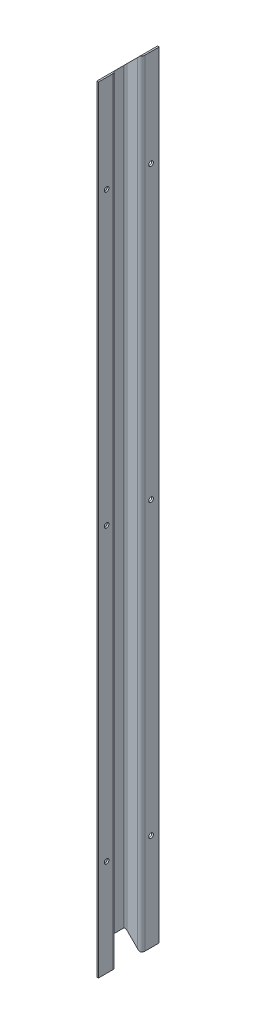
ISO-10303-21;
HEADER;
FILE_DESCRIPTION(('STEP AP214'),'2;1');
FILE_NAME('part.step','',(''),(''),'','','');
FILE_SCHEMA(('AUTOMOTIVE_DESIGN { 1 0 10303 214 1 1 1 1 }'));
ENDSEC;
DATA;
#1=APPLICATION_CONTEXT('core data for automotive mechanical design processes');
#2=APPLICATION_PROTOCOL_DEFINITION('international standard','automotive_design',2000,#1);
#3=PRODUCT_CONTEXT('',#1,'mechanical');
#4=PRODUCT('Part','Part','',(#3));
#5=PRODUCT_RELATED_PRODUCT_CATEGORY('part','',(#4));
#6=PRODUCT_DEFINITION_FORMATION('','',#4);
#7=PRODUCT_DEFINITION_CONTEXT('part definition',#1,'design');
#8=PRODUCT_DEFINITION('design','',#6,#7);
#9=PRODUCT_DEFINITION_SHAPE('','',#8);
#10=(LENGTH_UNIT() NAMED_UNIT(*) SI_UNIT(.MILLI.,.METRE.));
#11=(NAMED_UNIT(*) PLANE_ANGLE_UNIT() SI_UNIT($,.RADIAN.));
#12=(NAMED_UNIT(*) SI_UNIT($,.STERADIAN.) SOLID_ANGLE_UNIT());
#13=UNCERTAINTY_MEASURE_WITH_UNIT(LENGTH_MEASURE(1.E-05),#10,'distance_accuracy_value','');
#14=(GEOMETRIC_REPRESENTATION_CONTEXT(3) GLOBAL_UNCERTAINTY_ASSIGNED_CONTEXT((#13)) GLOBAL_UNIT_ASSIGNED_CONTEXT((#10,
#11,#12)) REPRESENTATION_CONTEXT('',''));
#15=CARTESIAN_POINT('',(0.,0.,0.));
#16=DIRECTION('',(0.,0.,1.));
#17=DIRECTION('',(1.,0.,0.));
#18=AXIS2_PLACEMENT_3D('',#15,#16,#17);
#19=CARTESIAN_POINT('',(12.7,-1219.2,-249.017002367974));
#20=DIRECTION('',(0.,0.,1.));
#21=DIRECTION('',(1.,0.,0.));
#22=AXIS2_PLACEMENT_3D('',#19,#20,#21);
#23=PLANE('',#22);
#24=DIRECTION('',(-0.707106781186548,0.707106781186548,0.));
#25=VECTOR('',#24,1.);
#26=CARTESIAN_POINT('',(12.568493857373,-1206.36849385737,-249.017002367974));
#27=LINE('',#26,#25);
#28=CARTESIAN_POINT('',(22.8092,-1216.6092,-249.017002367974));
#29=VERTEX_POINT('',#28);
#30=CARTESIAN_POINT('',(5.7658,-1199.5658,-249.017002367974));
#31=VERTEX_POINT('',#30);
#32=EDGE_CURVE('E371',#29,#31,#27,.T.);
#33=ORIENTED_EDGE('',*,*,#32,.F.);
#34=DIRECTION('',(0.,1.,0.));
#35=VECTOR('',#34,1.);
#36=CARTESIAN_POINT('',(22.8092,0.,-249.017002367974));
#37=LINE('',#36,#35);
#38=CARTESIAN_POINT('',(22.8092,-2.5908,-249.017002367974));
#39=VERTEX_POINT('',#38);
#40=EDGE_CURVE('E293',#29,#39,#37,.T.);
#41=ORIENTED_EDGE('',*,*,#40,.T.);
#42=DIRECTION('',(-0.707106781186548,-0.707106781186547,0.));
#43=VECTOR('',#42,1.);
#44=CARTESIAN_POINT('',(14.8809205779453,-10.5190794220546,-249.017002367974));
#45=LINE('',#44,#43);
#46=CARTESIAN_POINT('',(5.7658,-19.6342,-249.017002367974));
#47=VERTEX_POINT('',#46);
#48=EDGE_CURVE('E219',#39,#47,#45,.T.);
#49=ORIENTED_EDGE('',*,*,#48,.T.);
#50=DIRECTION('',(0.,1.,0.));
#51=VECTOR('',#50,1.);
#52=CARTESIAN_POINT('',(5.7658,-1219.2,-249.017002367974));
#53=LINE('',#52,#51);
#54=EDGE_CURVE('E496',#47,#31,#53,.F.);
#55=ORIENTED_EDGE('',*,*,#54,.T.);
#56=EDGE_LOOP('',(#33,#41,#49,#55));
#57=FACE_BOUND('',#56,.T.);
#58=ADVANCED_FACE('F16',(#57),#23,.T.);
#59=CARTESIAN_POINT('',(0.,-1219.2,-271.242002367973));
#60=DIRECTION('',(1.,0.,0.));
#61=DIRECTION('',(0.,0.,-1.));
#62=AXIS2_PLACEMENT_3D('',#59,#60,#61);
#63=PLANE('',#62);
#64=DIRECTION('',(0.,0.,-1.));
#65=VECTOR('',#64,1.);
#66=CARTESIAN_POINT('',(0.,-1193.8,-249.017002367974));
#67=LINE('',#66,#65);
#68=CARTESIAN_POINT('',(0.,-1193.8,-254.782802367973));
#69=VERTEX_POINT('',#68);
#70=CARTESIAN_POINT('',(0.,-1193.8,-287.701202367973));
#71=VERTEX_POINT('',#70);
#72=EDGE_CURVE('E374',#69,#71,#67,.T.);
#73=ORIENTED_EDGE('',*,*,#72,.F.);
#74=DIRECTION('',(0.,1.,0.));
#75=VECTOR('',#74,1.);
#76=CARTESIAN_POINT('',(0.,0.,-254.782802367973));
#77=LINE('',#76,#75);
#78=CARTESIAN_POINT('',(0.,-25.4,-254.782802367973));
#79=VERTEX_POINT('',#78);
#80=EDGE_CURVE('E486',#69,#79,#77,.T.);
#81=ORIENTED_EDGE('',*,*,#80,.T.);
#82=DIRECTION('',(0.,0.,-1.));
#83=VECTOR('',#82,1.);
#84=CARTESIAN_POINT('',(0.,-25.4,-249.017002367974));
#85=LINE('',#84,#83);
#86=CARTESIAN_POINT('',(0.,-25.4,-287.701202367973));
#87=VERTEX_POINT('',#86);
#88=EDGE_CURVE('E386',#79,#87,#85,.T.);
#89=ORIENTED_EDGE('',*,*,#88,.T.);
#90=DIRECTION('',(0.,1.,0.));
#91=VECTOR('',#90,1.);
#92=CARTESIAN_POINT('',(0.,-1219.2,-287.701202367973));
#93=LINE('',#92,#91);
#94=EDGE_CURVE('E229',#87,#71,#93,.F.);
#95=ORIENTED_EDGE('',*,*,#94,.T.);
#96=EDGE_LOOP('',(#73,#81,#89,#95));
#97=FACE_BOUND('',#96,.T.);
#98=ADVANCED_FACE('F539',(#97),#63,.F.);
#99=CARTESIAN_POINT('',(12.7,-1219.2,-293.467002367973));
#100=DIRECTION('',(0.,0.,1.));
#101=DIRECTION('',(1.,0.,0.));
#102=AXIS2_PLACEMENT_3D('',#99,#100,#101);
#103=PLANE('',#102);
#104=DIRECTION('',(-0.707106781186548,-0.707106781186547,0.));
#105=VECTOR('',#104,1.);
#106=CARTESIAN_POINT('',(14.8809205779453,-10.5190794220546,-293.467002367973));
#107=LINE('',#106,#105);
#108=CARTESIAN_POINT('',(22.8092,-2.5908,-293.467002367973));
#109=VERTEX_POINT('',#108);
#110=CARTESIAN_POINT('',(5.7658,-19.6342,-293.467002367973));
#111=VERTEX_POINT('',#110);
#112=EDGE_CURVE('E207',#109,#111,#107,.T.);
#113=ORIENTED_EDGE('',*,*,#112,.F.);
#114=DIRECTION('',(0.,1.,0.));
#115=VECTOR('',#114,1.);
#116=CARTESIAN_POINT('',(22.8092,-1219.2,-293.467002367973));
#117=LINE('',#116,#115);
#118=CARTESIAN_POINT('',(22.8092,-1216.6092,-293.467002367973));
#119=VERTEX_POINT('',#118);
#120=EDGE_CURVE('E278',#109,#119,#117,.F.);
#121=ORIENTED_EDGE('',*,*,#120,.T.);
#122=DIRECTION('',(-0.707106781186548,0.707106781186548,0.));
#123=VECTOR('',#122,1.);
#124=CARTESIAN_POINT('',(12.568493857373,-1206.36849385737,-293.467002367973));
#125=LINE('',#124,#123);
#126=CARTESIAN_POINT('',(5.7658,-1199.5658,-293.467002367973));
#127=VERTEX_POINT('',#126);
#128=EDGE_CURVE('E236',#119,#127,#125,.T.);
#129=ORIENTED_EDGE('',*,*,#128,.T.);
#130=DIRECTION('',(0.,1.,0.));
#131=VECTOR('',#130,1.);
#132=CARTESIAN_POINT('',(5.7658,-1219.2,-293.467002367973));
#133=LINE('',#132,#131);
#134=EDGE_CURVE('E227',#127,#111,#133,.T.);
#135=ORIENTED_EDGE('',*,*,#134,.T.);
#136=EDGE_LOOP('',(#113,#121,#129,#135));
#137=FACE_BOUND('',#136,.T.);
#138=ADVANCED_FACE('F234',(#137),#103,.F.);
#139=CARTESIAN_POINT('',(26.6954,-1219.2,-290.866042367973));
#140=DIRECTION('',(0.,0.,1.));
#141=DIRECTION('',(1.,0.,0.));
#142=AXIS2_PLACEMENT_3D('',#139,#140,#141);
#143=PLANE('',#142);
#144=DIRECTION('',(0.707106781186548,0.707106781186547,0.));
#145=VECTOR('',#144,1.);
#146=CARTESIAN_POINT('',(-583.5523,-608.9523,-290.866042367973));
#147=LINE('',#146,#145);
#148=CARTESIAN_POINT('',(5.19176,-20.20824,-290.866042367973));
#149=VERTEX_POINT('',#148);
#150=CARTESIAN_POINT('',(22.225,-3.17500000000015,-290.866042367973));
#151=VERTEX_POINT('',#150);
#152=EDGE_CURVE('E399',#149,#151,#147,.T.);
#153=ORIENTED_EDGE('',*,*,#152,.F.);
#154=DIRECTION('',(0.,1.,0.));
#155=VECTOR('',#154,1.);
#156=CARTESIAN_POINT('',(5.19176,-1196.40096,-290.866042367973));
#157=LINE('',#156,#155);
#158=CARTESIAN_POINT('',(5.19176,-1198.99176,-290.866042367973));
#159=VERTEX_POINT('',#158);
#160=EDGE_CURVE('E287',#149,#159,#157,.F.);
#161=ORIENTED_EDGE('',*,*,#160,.T.);
#162=DIRECTION('',(0.707106781186548,-0.707106781186548,0.));
#163=VECTOR('',#162,1.);
#164=CARTESIAN_POINT('',(26.0477,-1219.8477,-290.866042367973));
#165=LINE('',#164,#163);
#166=CARTESIAN_POINT('',(22.225,-1216.025,-290.866042367973));
#167=VERTEX_POINT('',#166);
#168=EDGE_CURVE('E413',#159,#167,#165,.T.);
#169=ORIENTED_EDGE('',*,*,#168,.T.);
#170=DIRECTION('',(0.,1.,0.));
#171=VECTOR('',#170,1.);
#172=CARTESIAN_POINT('',(22.225,-1219.2,-290.866042367973));
#173=LINE('',#172,#171);
#174=EDGE_CURVE('E239',#167,#151,#173,.T.);
#175=ORIENTED_EDGE('',*,*,#174,.T.);
#176=EDGE_LOOP('',(#153,#161,#169,#175));
#177=FACE_BOUND('',#176,.T.);
#178=ADVANCED_FACE('F561',(#177),#143,.T.);
#179=CARTESIAN_POINT('',(2.60096,-1219.2,-271.242002367973));
#180=DIRECTION('',(1.,0.,0.));
#181=DIRECTION('',(0.,0.,-1.));
#182=AXIS2_PLACEMENT_3D('',#179,#180,#181);
#183=PLANE('',#182);
#184=DIRECTION('',(0.,0.,-1.));
#185=VECTOR('',#184,1.);
#186=CARTESIAN_POINT('',(2.60096,-1196.40096,-271.242002367973));
#187=LINE('',#186,#185);
#188=CARTESIAN_POINT('',(2.60096,-1196.40096,-254.208762367973));
#189=VERTEX_POINT('',#188);
#190=CARTESIAN_POINT('',(2.60096,-1196.40096,-288.275242367973));
#191=VERTEX_POINT('',#190);
#192=EDGE_CURVE('E409',#189,#191,#187,.T.);
#193=ORIENTED_EDGE('',*,*,#192,.T.);
#194=DIRECTION('',(0.,1.,0.));
#195=VECTOR('',#194,1.);
#196=CARTESIAN_POINT('',(2.60096,-22.79904,-288.275242367973));
#197=LINE('',#196,#195);
#198=CARTESIAN_POINT('',(2.60096,-22.79904,-288.275242367973));
#199=VERTEX_POINT('',#198);
#200=EDGE_CURVE('E284',#191,#199,#197,.T.);
#201=ORIENTED_EDGE('',*,*,#200,.T.);
#202=DIRECTION('',(0.,0.,-1.));
#203=VECTOR('',#202,1.);
#204=CARTESIAN_POINT('',(2.60096,-22.79904,-271.242002367973));
#205=LINE('',#204,#203);
#206=CARTESIAN_POINT('',(2.60096,-22.79904,-254.208762367973));
#207=VERTEX_POINT('',#206);
#208=EDGE_CURVE('E395',#207,#199,#205,.T.);
#209=ORIENTED_EDGE('',*,*,#208,.F.);
#210=DIRECTION('',(0.,1.,0.));
#211=VECTOR('',#210,1.);
#212=CARTESIAN_POINT('',(2.60096,-1219.2,-254.208762367973));
#213=LINE('',#212,#211);
#214=EDGE_CURVE('E281',#207,#189,#213,.F.);
#215=ORIENTED_EDGE('',*,*,#214,.T.);
#216=EDGE_LOOP('',(#193,#201,#209,#215));
#217=FACE_BOUND('',#216,.T.);
#218=ADVANCED_FACE('F551',(#217),#183,.T.);
#219=CARTESIAN_POINT('',(14.00048,-1219.2,-251.617962367973));
#220=DIRECTION('',(0.,0.,1.));
#221=DIRECTION('',(1.,0.,0.));
#222=AXIS2_PLACEMENT_3D('',#219,#220,#221);
#223=PLANE('',#222);
#224=DIRECTION('',(0.707106781186548,-0.707106781186548,0.));
#225=VECTOR('',#224,1.);
#226=CARTESIAN_POINT('',(19.70024,-1213.50024,-251.617962367973));
#227=LINE('',#226,#225);
#228=CARTESIAN_POINT('',(5.19176,-1198.99176,-251.617962367973));
#229=VERTEX_POINT('',#228);
#230=CARTESIAN_POINT('',(22.225,-1216.025,-251.617962367973));
#231=VERTEX_POINT('',#230);
#232=EDGE_CURVE('E406',#229,#231,#227,.T.);
#233=ORIENTED_EDGE('',*,*,#232,.F.);
#234=DIRECTION('',(0.,1.,0.));
#235=VECTOR('',#234,1.);
#236=CARTESIAN_POINT('',(5.19176,-1219.2,-251.617962367973));
#237=LINE('',#236,#235);
#238=CARTESIAN_POINT('',(5.19175999999988,-20.20824,-251.617962367973));
#239=VERTEX_POINT('',#238);
#240=EDGE_CURVE('E289',#229,#239,#237,.T.);
#241=ORIENTED_EDGE('',*,*,#240,.T.);
#242=DIRECTION('',(0.707106781186548,0.707106781186547,0.));
#243=VECTOR('',#242,1.);
#244=CARTESIAN_POINT('',(-589.89976,-615.29976,-251.617962367973));
#245=LINE('',#244,#243);
#246=CARTESIAN_POINT('',(22.225,-3.17500000000015,-251.617962367973));
#247=VERTEX_POINT('',#246);
#248=EDGE_CURVE('E384',#239,#247,#245,.T.);
#249=ORIENTED_EDGE('',*,*,#248,.T.);
#250=DIRECTION('',(0.,1.,0.));
#251=VECTOR('',#250,1.);
#252=CARTESIAN_POINT('',(22.225,-1219.2,-251.617962367973));
#253=LINE('',#252,#251);
#254=EDGE_CURVE('E262',#247,#231,#253,.F.);
#255=ORIENTED_EDGE('',*,*,#254,.T.);
#256=EDGE_LOOP('',(#233,#241,#249,#255));
#257=FACE_BOUND('',#256,.T.);
#258=ADVANCED_FACE('F543',(#257),#223,.F.);
#259=CARTESIAN_POINT('',(13.9954,-1219.2,-271.242002367973));
#260=DIRECTION('',(0.,-1.,0.));
#261=DIRECTION('',(1.,0.,0.));
#262=AXIS2_PLACEMENT_3D('',#259,#260,#261);
#263=PLANE('',#262);
#264=DIRECTION('',(0.,0.,1.));
#265=VECTOR('',#264,1.);
#266=CARTESIAN_POINT('',(25.4,-1219.2,-236.317002367974));
#267=LINE('',#266,#265);
#268=CARTESIAN_POINT('',(25.4,-1219.2,-246.426202367974));
#269=VERTEX_POINT('',#268);
#270=CARTESIAN_POINT('',(25.4,-1219.2,-223.617002367974));
#271=VERTEX_POINT('',#270);
#272=EDGE_CURVE('E447',#269,#271,#267,.T.);
#273=ORIENTED_EDGE('',*,*,#272,.F.);
#274=DIRECTION('',(0.,0.,-1.));
#275=VECTOR('',#274,1.);
#276=CARTESIAN_POINT('',(25.4,-1219.2,-249.017002367974));
#277=LINE('',#276,#275);
#278=CARTESIAN_POINT('',(25.4,-1219.2,-250.665043484311));
#279=VERTEX_POINT('',#278);
#280=EDGE_CURVE('E380',#269,#279,#277,.T.);
#281=ORIENTED_EDGE('',*,*,#280,.T.);
#282=CARTESIAN_POINT('',(22.225,-1219.2,-245.852162367974));
#283=DIRECTION('',(0.,-1.,0.));
#284=DIRECTION('',(0.,0.,-1.));
#285=AXIS2_PLACEMENT_3D('',#282,#283,#284);
#286=CIRCLE('',#285,5.7658);
#287=CARTESIAN_POINT('',(27.9908,-1219.2,-245.852162367974));
#288=VERTEX_POINT('',#287);
#289=EDGE_CURVE('E252',#279,#288,#286,.T.);
#290=ORIENTED_EDGE('',*,*,#289,.T.);
#291=DIRECTION('',(0.,0.,-1.));
#292=VECTOR('',#291,1.);
#293=CARTESIAN_POINT('',(27.9908,-1219.2,-250.317482367973));
#294=LINE('',#293,#292);
#295=CARTESIAN_POINT('',(27.9908,-1219.2,-223.617002367974));
#296=VERTEX_POINT('',#295);
#297=EDGE_CURVE('E439',#296,#288,#294,.T.);
#298=ORIENTED_EDGE('',*,*,#297,.F.);
#299=DIRECTION('',(1.,0.,0.));
#300=VECTOR('',#299,1.);
#301=CARTESIAN_POINT('',(26.6954,-1219.2,-223.617002367974));
#302=LINE('',#301,#300);
#303=EDGE_CURVE('E443',#271,#296,#302,.T.);
#304=ORIENTED_EDGE('',*,*,#303,.F.);
#305=EDGE_LOOP('',(#273,#281,#290,#298,#304));
#306=FACE_BOUND('',#305,.T.);
#307=ADVANCED_FACE('F505',(#306),#263,.T.);
#308=CARTESIAN_POINT('',(22.225,-1219.2,-296.631842367973));
#309=DIRECTION('',(0.,-1.,0.));
#310=DIRECTION('',(0.,0.,-1.));
#311=AXIS2_PLACEMENT_3D('',#308,#309,#310);
#312=CIRCLE('',#311,5.7658);
#313=CARTESIAN_POINT('',(27.9908,-1219.2,-296.631842367973));
#314=VERTEX_POINT('',#313);
#315=CARTESIAN_POINT('',(25.4,-1219.2,-291.818961251635));
#316=VERTEX_POINT('',#315);
#317=EDGE_CURVE('E240',#314,#316,#312,.T.);
#318=ORIENTED_EDGE('',*,*,#317,.T.);
#319=CARTESIAN_POINT('',(25.4,-1219.2,-296.057802367973));
#320=VERTEX_POINT('',#319);
#321=EDGE_CURVE('E379',#316,#320,#277,.T.);
#322=ORIENTED_EDGE('',*,*,#321,.T.);
#323=DIRECTION('',(0.,0.,-1.));
#324=VECTOR('',#323,1.);
#325=CARTESIAN_POINT('',(25.4,-1219.2,-306.167002367974));
#326=LINE('',#325,#324);
#327=CARTESIAN_POINT('',(25.4,-1219.2,-318.867002367973));
#328=VERTEX_POINT('',#327);
#329=EDGE_CURVE('E428',#320,#328,#326,.T.);
#330=ORIENTED_EDGE('',*,*,#329,.T.);
#331=DIRECTION('',(1.,0.,0.));
#332=VECTOR('',#331,1.);
#333=CARTESIAN_POINT('',(26.6954,-1219.2,-318.867002367973));
#334=LINE('',#333,#332);
#335=CARTESIAN_POINT('',(27.9908,-1219.2,-318.867002367973));
#336=VERTEX_POINT('',#335);
#337=EDGE_CURVE('E431',#328,#336,#334,.T.);
#338=ORIENTED_EDGE('',*,*,#337,.T.);
#339=DIRECTION('',(0.,0.,-1.));
#340=VECTOR('',#339,1.);
#341=CARTESIAN_POINT('',(27.9908,-1219.2,-306.167002367974));
#342=LINE('',#341,#340);
#343=EDGE_CURVE('E436',#314,#336,#342,.T.);
#344=ORIENTED_EDGE('',*,*,#343,.F.);
#345=EDGE_LOOP('',(#318,#322,#330,#338,#344));
#346=FACE_BOUND('',#345,.T.);
#347=ADVANCED_FACE('F750',(#346),#263,.T.);
#348=CARTESIAN_POINT('',(13.9954,0.,-271.242002367973));
#349=DIRECTION('',(0.,-1.,0.));
#350=DIRECTION('',(1.,0.,0.));
#351=AXIS2_PLACEMENT_3D('',#348,#349,#350);
#352=PLANE('',#351);
#353=DIRECTION('',(0.,0.,-1.));
#354=VECTOR('',#353,1.);
#355=CARTESIAN_POINT('',(25.4,0.,-249.017002367974));
#356=LINE('',#355,#354);
#357=CARTESIAN_POINT('',(25.4,0.,-246.426202367974));
#358=VERTEX_POINT('',#357);
#359=CARTESIAN_POINT('',(25.4,0.,-250.665043484311));
#360=VERTEX_POINT('',#359);
#361=EDGE_CURVE('E40',#358,#360,#356,.T.);
#362=ORIENTED_EDGE('',*,*,#361,.F.);
#363=DIRECTION('',(0.,0.,1.));
#364=VECTOR('',#363,1.);
#365=CARTESIAN_POINT('',(25.4,0.,-236.317002367974));
#366=LINE('',#365,#364);
#367=CARTESIAN_POINT('',(25.4,0.,-223.617002367974));
#368=VERTEX_POINT('',#367);
#369=EDGE_CURVE('E432',#358,#368,#366,.T.);
#370=ORIENTED_EDGE('',*,*,#369,.T.);
#371=DIRECTION('',(1.,0.,0.));
#372=VECTOR('',#371,1.);
#373=CARTESIAN_POINT('',(26.6954,0.,-223.617002367974));
#374=LINE('',#373,#372);
#375=CARTESIAN_POINT('',(27.9908,0.,-223.617002367974));
#376=VERTEX_POINT('',#375);
#377=EDGE_CURVE('E464',#368,#376,#374,.T.);
#378=ORIENTED_EDGE('',*,*,#377,.T.);
#379=DIRECTION('',(0.,0.,-1.));
#380=VECTOR('',#379,1.);
#381=CARTESIAN_POINT('',(27.9908,0.,-250.317482367973));
#382=LINE('',#381,#380);
#383=CARTESIAN_POINT('',(27.9908,0.,-245.852162367974));
#384=VERTEX_POINT('',#383);
#385=EDGE_CURVE('E460',#376,#384,#382,.T.);
#386=ORIENTED_EDGE('',*,*,#385,.T.);
#387=CARTESIAN_POINT('',(22.225,0.,-245.852162367974));
#388=DIRECTION('',(0.,-1.,0.));
#389=DIRECTION('',(0.,0.,-1.));
#390=AXIS2_PLACEMENT_3D('',#387,#388,#389);
#391=CIRCLE('',#390,5.7658);
#392=EDGE_CURVE('E490',#384,#360,#391,.F.);
#393=ORIENTED_EDGE('',*,*,#392,.T.);
#394=EDGE_LOOP('',(#362,#370,#378,#386,#393));
#395=FACE_BOUND('',#394,.T.);
#396=ADVANCED_FACE('F516',(#395),#352,.F.);
#397=CARTESIAN_POINT('',(25.4,0.,-291.818961251635));
#398=VERTEX_POINT('',#397);
#399=CARTESIAN_POINT('',(25.4,0.,-296.057802367973));
#400=VERTEX_POINT('',#399);
#401=EDGE_CURVE('E390',#398,#400,#356,.T.);
#402=ORIENTED_EDGE('',*,*,#401,.F.);
#403=CARTESIAN_POINT('',(22.225,0.,-296.631842367973));
#404=DIRECTION('',(0.,-1.,0.));
#405=DIRECTION('',(0.,0.,-1.));
#406=AXIS2_PLACEMENT_3D('',#403,#404,#405);
#407=CIRCLE('',#406,5.7658);
#408=CARTESIAN_POINT('',(27.9908,0.,-296.631842367973));
#409=VERTEX_POINT('',#408);
#410=EDGE_CURVE('E493',#398,#409,#407,.F.);
#411=ORIENTED_EDGE('',*,*,#410,.T.);
#412=DIRECTION('',(0.,0.,-1.));
#413=VECTOR('',#412,1.);
#414=CARTESIAN_POINT('',(27.9908,0.,-306.167002367974));
#415=LINE('',#414,#413);
#416=CARTESIAN_POINT('',(27.9908,0.,-318.867002367973));
#417=VERTEX_POINT('',#416);
#418=EDGE_CURVE('E457',#409,#417,#415,.T.);
#419=ORIENTED_EDGE('',*,*,#418,.T.);
#420=DIRECTION('',(1.,0.,0.));
#421=VECTOR('',#420,1.);
#422=CARTESIAN_POINT('',(26.6954,0.,-318.867002367973));
#423=LINE('',#422,#421);
#424=CARTESIAN_POINT('',(25.4,0.,-318.867002367973));
#425=VERTEX_POINT('',#424);
#426=EDGE_CURVE('E453',#425,#417,#423,.T.);
#427=ORIENTED_EDGE('',*,*,#426,.F.);
#428=DIRECTION('',(0.,0.,-1.));
#429=VECTOR('',#428,1.);
#430=CARTESIAN_POINT('',(25.4,0.,-306.167002367974));
#431=LINE('',#430,#429);
#432=EDGE_CURVE('E427',#400,#425,#431,.T.);
#433=ORIENTED_EDGE('',*,*,#432,.F.);
#434=EDGE_LOOP('',(#402,#411,#419,#427,#433));
#435=FACE_BOUND('',#434,.T.);
#436=ADVANCED_FACE('F573',(#435),#352,.F.);
#437=CARTESIAN_POINT('',(5.7658,-1219.2,-254.782802367973));
#438=DIRECTION('',(0.,-1.,0.));
#439=DIRECTION('',(0.,0.,-1.));
#440=AXIS2_PLACEMENT_3D('',#437,#438,#439);
#441=CYLINDRICAL_SURFACE('',#440,5.7658);
#442=ORIENTED_EDGE('',*,*,#80,.F.);
#443=CARTESIAN_POINT('',(5.7658,-1199.5658,-254.782802367973));
#444=DIRECTION('',(-0.707106781186548,-0.707106781186547,0.));
#445=DIRECTION('',(0.707106781186547,-0.707106781186548,0.));
#446=AXIS2_PLACEMENT_3D('',#443,#444,#445);
#447=ELLIPSE('',#446,8.1540725579308,5.7658);
#448=EDGE_CURVE('E423',#69,#31,#447,.F.);
#449=ORIENTED_EDGE('',*,*,#448,.T.);
#450=ORIENTED_EDGE('',*,*,#54,.F.);
#451=CARTESIAN_POINT('',(5.7658,-19.6342,-254.782802367973));
#452=DIRECTION('',(0.707106781186547,-0.707106781186548,0.));
#453=DIRECTION('',(-0.707106781186548,-0.707106781186547,0.));
#454=AXIS2_PLACEMENT_3D('',#451,#452,#453);
#455=ELLIPSE('',#454,8.15407255793079,5.7658);
#456=EDGE_CURVE('E231',#79,#47,#455,.F.);
#457=ORIENTED_EDGE('',*,*,#456,.F.);
#458=EDGE_LOOP('',(#442,#449,#450,#457));
#459=FACE_BOUND('',#458,.T.);
#460=ADVANCED_FACE('F536',(#459),#441,.T.);
#461=CARTESIAN_POINT('',(5.7658,-1219.2,-287.701202367973));
#462=DIRECTION('',(0.,1.,0.));
#463=DIRECTION('',(0.,0.,1.));
#464=AXIS2_PLACEMENT_3D('',#461,#462,#463);
#465=CYLINDRICAL_SURFACE('',#464,5.7658);
#466=ORIENTED_EDGE('',*,*,#134,.F.);
#467=CARTESIAN_POINT('',(5.7658,-1199.5658,-287.701202367973));
#468=DIRECTION('',(-0.707106781186548,-0.707106781186547,0.));
#469=DIRECTION('',(-0.707106781186547,0.707106781186548,0.));
#470=AXIS2_PLACEMENT_3D('',#467,#468,#469);
#471=ELLIPSE('',#470,8.1540725579308,5.7658);
#472=EDGE_CURVE('E420',#127,#71,#471,.F.);
#473=ORIENTED_EDGE('',*,*,#472,.T.);
#474=ORIENTED_EDGE('',*,*,#94,.F.);
#475=CARTESIAN_POINT('',(5.7658,-19.6342,-287.701202367973));
#476=DIRECTION('',(0.707106781186547,-0.707106781186548,0.));
#477=DIRECTION('',(0.707106781186548,0.707106781186547,0.));
#478=AXIS2_PLACEMENT_3D('',#475,#476,#477);
#479=ELLIPSE('',#478,8.15407255793079,5.7658);
#480=EDGE_CURVE('E211',#111,#87,#479,.F.);
#481=ORIENTED_EDGE('',*,*,#480,.F.);
#482=EDGE_LOOP('',(#466,#473,#474,#481));
#483=FACE_BOUND('',#482,.T.);
#484=ADVANCED_FACE('F225',(#483),#465,.T.);
#485=CARTESIAN_POINT('',(22.225,-1219.2,-296.631842367973));
#486=DIRECTION('',(0.,1.,0.));
#487=DIRECTION('',(0.,0.,1.));
#488=AXIS2_PLACEMENT_3D('',#485,#486,#487);
#489=CYLINDRICAL_SURFACE('',#488,5.7658);
#490=ORIENTED_EDGE('',*,*,#174,.F.);
#491=CARTESIAN_POINT('',(22.225,-1216.025,-296.631842367973));
#492=DIRECTION('',(-0.707106781186548,-0.707106781186547,0.));
#493=DIRECTION('',(-0.707106781186547,0.707106781186548,0.));
#494=AXIS2_PLACEMENT_3D('',#491,#492,#493);
#495=ELLIPSE('',#494,8.1540725579308,5.7658);
#496=EDGE_CURVE('E416',#167,#316,#495,.F.);
#497=ORIENTED_EDGE('',*,*,#496,.T.);
#498=ORIENTED_EDGE('',*,*,#317,.F.);
#499=DIRECTION('',(0.,1.,0.));
#500=VECTOR('',#499,1.);
#501=CARTESIAN_POINT('',(27.9908,-1219.2,-296.631842367973));
#502=LINE('',#501,#500);
#503=EDGE_CURVE('E248',#409,#314,#502,.F.);
#504=ORIENTED_EDGE('',*,*,#503,.F.);
#505=ORIENTED_EDGE('',*,*,#410,.F.);
#506=CARTESIAN_POINT('',(22.225,-3.17500000000015,-296.631842367973));
#507=DIRECTION('',(0.707106781186547,-0.707106781186548,0.));
#508=DIRECTION('',(0.707106781186548,0.707106781186547,0.));
#509=AXIS2_PLACEMENT_3D('',#506,#507,#508);
#510=ELLIPSE('',#509,8.15407255793079,5.7658);
#511=EDGE_CURVE('E232',#151,#398,#510,.F.);
#512=ORIENTED_EDGE('',*,*,#511,.F.);
#513=EDGE_LOOP('',(#490,#497,#498,#504,#505,#512));
#514=FACE_BOUND('',#513,.T.);
#515=ADVANCED_FACE('F566',(#514),#489,.T.);
#516=CARTESIAN_POINT('',(22.225,-1219.2,-245.852162367974));
#517=DIRECTION('',(0.,-1.,0.));
#518=DIRECTION('',(0.,0.,-1.));
#519=AXIS2_PLACEMENT_3D('',#516,#517,#518);
#520=CYLINDRICAL_SURFACE('',#519,5.7658);
#521=ORIENTED_EDGE('',*,*,#289,.F.);
#522=CARTESIAN_POINT('',(22.225,-1216.025,-245.852162367974));
#523=DIRECTION('',(-0.707106781186548,-0.707106781186547,0.));
#524=DIRECTION('',(0.707106781186547,-0.707106781186548,0.));
#525=AXIS2_PLACEMENT_3D('',#522,#523,#524);
#526=ELLIPSE('',#525,8.1540725579308,5.7658);
#527=EDGE_CURVE('E270',#279,#231,#526,.F.);
#528=ORIENTED_EDGE('',*,*,#527,.T.);
#529=ORIENTED_EDGE('',*,*,#254,.F.);
#530=CARTESIAN_POINT('',(22.225,-3.17500000000015,-245.852162367974));
#531=DIRECTION('',(0.707106781186547,-0.707106781186548,0.));
#532=DIRECTION('',(-0.707106781186548,-0.707106781186547,0.));
#533=AXIS2_PLACEMENT_3D('',#530,#531,#532);
#534=ELLIPSE('',#533,8.15407255793079,5.7658);
#535=EDGE_CURVE('E266',#360,#247,#534,.F.);
#536=ORIENTED_EDGE('',*,*,#535,.F.);
#537=ORIENTED_EDGE('',*,*,#392,.F.);
#538=DIRECTION('',(0.,1.,0.));
#539=VECTOR('',#538,1.);
#540=CARTESIAN_POINT('',(27.9908,0.,-245.852162367974));
#541=LINE('',#540,#539);
#542=EDGE_CURVE('E258',#288,#384,#541,.T.);
#543=ORIENTED_EDGE('',*,*,#542,.F.);
#544=EDGE_LOOP('',(#521,#528,#529,#536,#537,#543));
#545=FACE_BOUND('',#544,.T.);
#546=ADVANCED_FACE('F513',(#545),#520,.T.);
#547=CARTESIAN_POINT('',(25.4,-1219.2,-306.167002367974));
#548=DIRECTION('',(1.,0.,0.));
#549=DIRECTION('',(0.,0.,-1.));
#550=AXIS2_PLACEMENT_3D('',#547,#548,#549);
#551=PLANE('',#550);
#552=CARTESIAN_POINT('',(25.4,-152.4,-306.167002367974));
#553=DIRECTION('',(1.,0.,0.));
#554=DIRECTION('',(0.,0.,-1.));
#555=AXIS2_PLACEMENT_3D('',#552,#553,#554);
#556=CIRCLE('',#555,3.683);
#557=CARTESIAN_POINT('',(25.4,-152.4,-309.850002367974));
#558=VERTEX_POINT('',#557);
#559=EDGE_CURVE('E20',#558,#558,#556,.F.);
#560=ORIENTED_EDGE('',*,*,#559,.F.);
#561=EDGE_LOOP('',(#560));
#562=FACE_BOUND('',#561,.T.);
#563=CARTESIAN_POINT('',(25.4,-1066.8,-306.167002367974));
#564=DIRECTION('',(1.,0.,0.));
#565=DIRECTION('',(0.,0.,-1.));
#566=AXIS2_PLACEMENT_3D('',#563,#564,#565);
#567=CIRCLE('',#566,3.683);
#568=CARTESIAN_POINT('',(25.4,-1066.8,-309.850002367974));
#569=VERTEX_POINT('',#568);
#570=EDGE_CURVE('E336',#569,#569,#567,.F.);
#571=ORIENTED_EDGE('',*,*,#570,.F.);
#572=EDGE_LOOP('',(#571));
#573=FACE_BOUND('',#572,.T.);
#574=CARTESIAN_POINT('',(25.4,-609.6,-306.167002367974));
#575=DIRECTION('',(1.,0.,0.));
#576=DIRECTION('',(0.,0.,-1.));
#577=AXIS2_PLACEMENT_3D('',#574,#575,#576);
#578=CIRCLE('',#577,3.683);
#579=CARTESIAN_POINT('',(25.4,-609.6,-309.850002367974));
#580=VERTEX_POINT('',#579);
#581=EDGE_CURVE('E326',#580,#580,#578,.F.);
#582=ORIENTED_EDGE('',*,*,#581,.F.);
#583=EDGE_LOOP('',(#582));
#584=FACE_BOUND('',#583,.T.);
#585=ORIENTED_EDGE('',*,*,#329,.F.);
#586=DIRECTION('',(0.,1.,0.));
#587=VECTOR('',#586,1.);
#588=CARTESIAN_POINT('',(25.4,0.,-296.057802367973));
#589=LINE('',#588,#587);
#590=EDGE_CURVE('E274',#320,#400,#589,.T.);
#591=ORIENTED_EDGE('',*,*,#590,.T.);
#592=ORIENTED_EDGE('',*,*,#432,.T.);
#593=DIRECTION('',(0.,1.,0.));
#594=VECTOR('',#593,1.);
#595=CARTESIAN_POINT('',(25.4,-1219.2,-318.867002367973));
#596=LINE('',#595,#594);
#597=EDGE_CURVE('E480',#328,#425,#596,.T.);
#598=ORIENTED_EDGE('',*,*,#597,.F.);
#599=EDGE_LOOP('',(#585,#591,#592,#598));
#600=FACE_BOUND('',#599,.T.);
#601=ADVANCED_FACE('F888',(#562,#573,#584,#600),#551,.F.);
#602=CARTESIAN_POINT('',(26.6954,-1219.2,-318.867002367973));
#603=DIRECTION('',(0.,0.,1.));
#604=DIRECTION('',(1.,0.,0.));
#605=AXIS2_PLACEMENT_3D('',#602,#603,#604);
#606=PLANE('',#605);
#607=ORIENTED_EDGE('',*,*,#426,.T.);
#608=DIRECTION('',(0.,1.,0.));
#609=VECTOR('',#608,1.);
#610=CARTESIAN_POINT('',(27.9908,-1219.2,-318.867002367973));
#611=LINE('',#610,#609);
#612=EDGE_CURVE('E476',#336,#417,#611,.T.);
#613=ORIENTED_EDGE('',*,*,#612,.F.);
#614=ORIENTED_EDGE('',*,*,#337,.F.);
#615=ORIENTED_EDGE('',*,*,#597,.T.);
#616=EDGE_LOOP('',(#607,#613,#614,#615));
#617=FACE_BOUND('',#616,.T.);
#618=ADVANCED_FACE('F881',(#617),#606,.F.);
#619=CARTESIAN_POINT('',(27.9908,-1219.2,-306.167002367974));
#620=DIRECTION('',(1.,0.,0.));
#621=DIRECTION('',(0.,0.,-1.));
#622=AXIS2_PLACEMENT_3D('',#619,#620,#621);
#623=PLANE('',#622);
#624=CARTESIAN_POINT('',(27.9908,-152.4,-306.167002367974));
#625=DIRECTION('',(1.,0.,0.));
#626=DIRECTION('',(0.,0.,-1.));
#627=AXIS2_PLACEMENT_3D('',#624,#625,#626);
#628=CIRCLE('',#627,3.683);
#629=CARTESIAN_POINT('',(27.9908,-152.4,-309.850002367974));
#630=VERTEX_POINT('',#629);
#631=EDGE_CURVE('E359',#630,#630,#628,.T.);
#632=ORIENTED_EDGE('',*,*,#631,.F.);
#633=EDGE_LOOP('',(#632));
#634=FACE_BOUND('',#633,.T.);
#635=CARTESIAN_POINT('',(27.9908,-1066.8,-306.167002367974));
#636=DIRECTION('',(1.,0.,0.));
#637=DIRECTION('',(0.,0.,-1.));
#638=AXIS2_PLACEMENT_3D('',#635,#636,#637);
#639=CIRCLE('',#638,3.683);
#640=CARTESIAN_POINT('',(27.9908,-1066.8,-309.850002367974));
#641=VERTEX_POINT('',#640);
#642=EDGE_CURVE('E339',#641,#641,#639,.T.);
#643=ORIENTED_EDGE('',*,*,#642,.F.);
#644=EDGE_LOOP('',(#643));
#645=FACE_BOUND('',#644,.T.);
#646=CARTESIAN_POINT('',(27.9908,-609.6,-306.167002367974));
#647=DIRECTION('',(1.,0.,0.));
#648=DIRECTION('',(0.,0.,-1.));
#649=AXIS2_PLACEMENT_3D('',#646,#647,#648);
#650=CIRCLE('',#649,3.683);
#651=CARTESIAN_POINT('',(27.9908,-609.6,-309.850002367974));
#652=VERTEX_POINT('',#651);
#653=EDGE_CURVE('E330',#652,#652,#650,.T.);
#654=ORIENTED_EDGE('',*,*,#653,.F.);
#655=EDGE_LOOP('',(#654));
#656=FACE_BOUND('',#655,.T.);
#657=ORIENTED_EDGE('',*,*,#418,.F.);
#658=ORIENTED_EDGE('',*,*,#503,.T.);
#659=ORIENTED_EDGE('',*,*,#343,.T.);
#660=ORIENTED_EDGE('',*,*,#612,.T.);
#661=EDGE_LOOP('',(#657,#658,#659,#660));
#662=FACE_BOUND('',#661,.T.);
#663=ADVANCED_FACE('F850',(#634,#645,#656,#662),#623,.T.);
#664=CARTESIAN_POINT('',(27.9908,-1219.2,-250.317482367973));
#665=DIRECTION('',(1.,0.,0.));
#666=DIRECTION('',(0.,0.,-1.));
#667=AXIS2_PLACEMENT_3D('',#664,#665,#666);
#668=PLANE('',#667);
#669=CARTESIAN_POINT('',(27.9908,-152.4,-236.317002367974));
#670=DIRECTION('',(1.,0.,0.));
#671=DIRECTION('',(0.,0.,-1.));
#672=AXIS2_PLACEMENT_3D('',#669,#670,#671);
#673=CIRCLE('',#672,3.683);
#674=CARTESIAN_POINT('',(27.9908,-152.4,-240.000002367974));
#675=VERTEX_POINT('',#674);
#676=EDGE_CURVE('E343',#675,#675,#673,.T.);
#677=ORIENTED_EDGE('',*,*,#676,.F.);
#678=EDGE_LOOP('',(#677));
#679=FACE_BOUND('',#678,.T.);
#680=CARTESIAN_POINT('',(27.9908,-1066.8,-236.317002367974));
#681=DIRECTION('',(1.,0.,0.));
#682=DIRECTION('',(0.,0.,-1.));
#683=AXIS2_PLACEMENT_3D('',#680,#681,#682);
#684=CIRCLE('',#683,3.683);
#685=CARTESIAN_POINT('',(27.9908,-1066.8,-240.000002367974));
#686=VERTEX_POINT('',#685);
#687=EDGE_CURVE('E335',#686,#686,#684,.T.);
#688=ORIENTED_EDGE('',*,*,#687,.F.);
#689=EDGE_LOOP('',(#688));
#690=FACE_BOUND('',#689,.T.);
#691=CARTESIAN_POINT('',(27.9908,-609.6,-236.317002367974));
#692=DIRECTION('',(1.,0.,0.));
#693=DIRECTION('',(0.,0.,-1.));
#694=AXIS2_PLACEMENT_3D('',#691,#692,#693);
#695=CIRCLE('',#694,3.683);
#696=CARTESIAN_POINT('',(27.9908,-609.6,-240.000002367974));
#697=VERTEX_POINT('',#696);
#698=EDGE_CURVE('E325',#697,#697,#695,.T.);
#699=ORIENTED_EDGE('',*,*,#698,.F.);
#700=EDGE_LOOP('',(#699));
#701=FACE_BOUND('',#700,.T.);
#702=ORIENTED_EDGE('',*,*,#297,.T.);
#703=ORIENTED_EDGE('',*,*,#542,.T.);
#704=ORIENTED_EDGE('',*,*,#385,.F.);
#705=DIRECTION('',(0.,1.,0.));
#706=VECTOR('',#705,1.);
#707=CARTESIAN_POINT('',(27.9908,-1219.2,-223.617002367974));
#708=LINE('',#707,#706);
#709=EDGE_CURVE('E473',#296,#376,#708,.T.);
#710=ORIENTED_EDGE('',*,*,#709,.F.);
#711=EDGE_LOOP('',(#702,#703,#704,#710));
#712=FACE_BOUND('',#711,.T.);
#713=ADVANCED_FACE('F511',(#679,#690,#701,#712),#668,.T.);
#714=CARTESIAN_POINT('',(26.6954,-1219.2,-223.617002367974));
#715=DIRECTION('',(0.,0.,1.));
#716=DIRECTION('',(1.,0.,0.));
#717=AXIS2_PLACEMENT_3D('',#714,#715,#716);
#718=PLANE('',#717);
#719=ORIENTED_EDGE('',*,*,#377,.F.);
#720=DIRECTION('',(0.,1.,0.));
#721=VECTOR('',#720,1.);
#722=CARTESIAN_POINT('',(25.4,-1219.2,-223.617002367974));
#723=LINE('',#722,#721);
#724=EDGE_CURVE('E450',#271,#368,#723,.T.);
#725=ORIENTED_EDGE('',*,*,#724,.F.);
#726=ORIENTED_EDGE('',*,*,#303,.T.);
#727=ORIENTED_EDGE('',*,*,#709,.T.);
#728=EDGE_LOOP('',(#719,#725,#726,#727));
#729=FACE_BOUND('',#728,.T.);
#730=ADVANCED_FACE('F520',(#729),#718,.T.);
#731=CARTESIAN_POINT('',(25.4,-1219.2,-236.317002367974));
#732=DIRECTION('',(-1.,0.,0.));
#733=DIRECTION('',(0.,0.,1.));
#734=AXIS2_PLACEMENT_3D('',#731,#732,#733);
#735=PLANE('',#734);
#736=CARTESIAN_POINT('',(25.4,-152.4,-236.317002367974));
#737=DIRECTION('',(-1.,0.,0.));
#738=DIRECTION('',(0.,0.,1.));
#739=AXIS2_PLACEMENT_3D('',#736,#737,#738);
#740=CIRCLE('',#739,3.683);
#741=CARTESIAN_POINT('',(25.4,-152.4,-232.634002367974));
#742=VERTEX_POINT('',#741);
#743=EDGE_CURVE('E340',#742,#742,#740,.F.);
#744=ORIENTED_EDGE('',*,*,#743,.T.);
#745=EDGE_LOOP('',(#744));
#746=FACE_BOUND('',#745,.T.);
#747=CARTESIAN_POINT('',(25.4,-1066.8,-236.317002367974));
#748=DIRECTION('',(-1.,0.,0.));
#749=DIRECTION('',(0.,0.,1.));
#750=AXIS2_PLACEMENT_3D('',#747,#748,#749);
#751=CIRCLE('',#750,3.683);
#752=CARTESIAN_POINT('',(25.4,-1066.8,-232.634002367974));
#753=VERTEX_POINT('',#752);
#754=EDGE_CURVE('E331',#753,#753,#751,.F.);
#755=ORIENTED_EDGE('',*,*,#754,.T.);
#756=EDGE_LOOP('',(#755));
#757=FACE_BOUND('',#756,.T.);
#758=CARTESIAN_POINT('',(25.4,-609.6,-236.317002367974));
#759=DIRECTION('',(-1.,0.,0.));
#760=DIRECTION('',(0.,0.,1.));
#761=AXIS2_PLACEMENT_3D('',#758,#759,#760);
#762=CIRCLE('',#761,3.683);
#763=CARTESIAN_POINT('',(25.4,-609.6,-232.634002367974));
#764=VERTEX_POINT('',#763);
#765=EDGE_CURVE('E220',#764,#764,#762,.F.);
#766=ORIENTED_EDGE('',*,*,#765,.T.);
#767=EDGE_LOOP('',(#766));
#768=FACE_BOUND('',#767,.T.);
#769=ORIENTED_EDGE('',*,*,#369,.F.);
#770=DIRECTION('',(0.,1.,0.));
#771=VECTOR('',#770,1.);
#772=CARTESIAN_POINT('',(25.4,-1219.2,-246.426202367974));
#773=LINE('',#772,#771);
#774=EDGE_CURVE('E297',#358,#269,#773,.F.);
#775=ORIENTED_EDGE('',*,*,#774,.T.);
#776=ORIENTED_EDGE('',*,*,#272,.T.);
#777=ORIENTED_EDGE('',*,*,#724,.T.);
#778=EDGE_LOOP('',(#769,#775,#776,#777));
#779=FACE_BOUND('',#778,.T.);
#780=ADVANCED_FACE('F691',(#746,#757,#768,#779),#735,.T.);
#781=CARTESIAN_POINT('',(14.8809205779453,-10.5190794220546,-249.017002367974));
#782=DIRECTION('',(0.707106781186547,-0.707106781186548,0.));
#783=DIRECTION('',(0.707106781186548,0.707106781186547,0.));
#784=AXIS2_PLACEMENT_3D('',#781,#782,#783);
#785=PLANE('',#784);
#786=ORIENTED_EDGE('',*,*,#456,.T.);
#787=ORIENTED_EDGE('',*,*,#48,.F.);
#788=CARTESIAN_POINT('',(22.8092,-2.59080000000011,-246.426202367974));
#789=DIRECTION('',(0.707106781186547,-0.707106781186548,0.));
#790=DIRECTION('',(-0.707106781186548,-0.707106781186547,0.));
#791=AXIS2_PLACEMENT_3D('',#788,#789,#790);
#792=ELLIPSE('',#791,3.66394449739622,2.5908);
#793=EDGE_CURVE('E27',#39,#358,#792,.T.);
#794=ORIENTED_EDGE('',*,*,#793,.T.);
#795=ORIENTED_EDGE('',*,*,#361,.T.);
#796=ORIENTED_EDGE('',*,*,#535,.T.);
#797=ORIENTED_EDGE('',*,*,#248,.F.);
#798=CARTESIAN_POINT('',(5.19176,-20.20824,-254.208762367973));
#799=DIRECTION('',(0.707106781186547,-0.707106781186548,0.));
#800=DIRECTION('',(0.707106781186548,0.707106781186547,0.));
#801=AXIS2_PLACEMENT_3D('',#798,#799,#800);
#802=ELLIPSE('',#801,3.66394449739622,2.5908);
#803=EDGE_CURVE('E313',#239,#207,#802,.T.);
#804=ORIENTED_EDGE('',*,*,#803,.T.);
#805=ORIENTED_EDGE('',*,*,#208,.T.);
#806=CARTESIAN_POINT('',(5.19176,-20.20824,-288.275242367973));
#807=DIRECTION('',(0.707106781186547,-0.707106781186548,0.));
#808=DIRECTION('',(-0.707106781186548,-0.707106781186547,0.));
#809=AXIS2_PLACEMENT_3D('',#806,#807,#808);
#810=ELLIPSE('',#809,3.66394449739622,2.5908);
#811=EDGE_CURVE('E307',#199,#149,#810,.T.);
#812=ORIENTED_EDGE('',*,*,#811,.T.);
#813=ORIENTED_EDGE('',*,*,#152,.T.);
#814=ORIENTED_EDGE('',*,*,#511,.T.);
#815=ORIENTED_EDGE('',*,*,#401,.T.);
#816=CARTESIAN_POINT('',(22.8092,-2.59080000000011,-296.057802367973));
#817=DIRECTION('',(0.707106781186547,-0.707106781186548,0.));
#818=DIRECTION('',(-0.707106781186548,-0.707106781186547,0.));
#819=AXIS2_PLACEMENT_3D('',#816,#817,#818);
#820=ELLIPSE('',#819,3.66394449739622,2.5908);
#821=EDGE_CURVE('E214',#400,#109,#820,.T.);
#822=ORIENTED_EDGE('',*,*,#821,.T.);
#823=ORIENTED_EDGE('',*,*,#112,.T.);
#824=ORIENTED_EDGE('',*,*,#480,.T.);
#825=ORIENTED_EDGE('',*,*,#88,.F.);
#826=EDGE_LOOP('',(#786,#787,#794,#795,#796,#797,#804,#805,#812,#813,#814,#815,#822,#823,#824,#825));
#827=FACE_BOUND('',#826,.T.);
#828=ADVANCED_FACE('F210',(#827),#785,.F.);
#829=CARTESIAN_POINT('',(12.568493857373,-1206.36849385737,-249.017002367974));
#830=DIRECTION('',(-0.707106781186548,-0.707106781186547,0.));
#831=DIRECTION('',(0.707106781186547,-0.707106781186548,0.));
#832=AXIS2_PLACEMENT_3D('',#829,#830,#831);
#833=PLANE('',#832);
#834=ORIENTED_EDGE('',*,*,#72,.T.);
#835=ORIENTED_EDGE('',*,*,#472,.F.);
#836=ORIENTED_EDGE('',*,*,#128,.F.);
#837=CARTESIAN_POINT('',(22.8092,-1216.6092,-296.057802367973));
#838=DIRECTION('',(-0.707106781186548,-0.707106781186547,0.));
#839=DIRECTION('',(0.707106781186547,-0.707106781186548,0.));
#840=AXIS2_PLACEMENT_3D('',#837,#838,#839);
#841=ELLIPSE('',#840,3.66394449739622,2.5908);
#842=EDGE_CURVE('E303',#119,#320,#841,.F.);
#843=ORIENTED_EDGE('',*,*,#842,.T.);
#844=ORIENTED_EDGE('',*,*,#321,.F.);
#845=ORIENTED_EDGE('',*,*,#496,.F.);
#846=ORIENTED_EDGE('',*,*,#168,.F.);
#847=CARTESIAN_POINT('',(5.19176,-1198.99176,-288.275242367973));
#848=DIRECTION('',(-0.707106781186548,-0.707106781186547,0.));
#849=DIRECTION('',(0.707106781186547,-0.707106781186548,0.));
#850=AXIS2_PLACEMENT_3D('',#847,#848,#849);
#851=ELLIPSE('',#850,3.66394449739622,2.5908);
#852=EDGE_CURVE('E310',#159,#191,#851,.F.);
#853=ORIENTED_EDGE('',*,*,#852,.T.);
#854=ORIENTED_EDGE('',*,*,#192,.F.);
#855=CARTESIAN_POINT('',(5.19176,-1198.99176,-254.208762367973));
#856=DIRECTION('',(-0.707106781186548,-0.707106781186547,0.));
#857=DIRECTION('',(-0.707106781186547,0.707106781186548,0.));
#858=AXIS2_PLACEMENT_3D('',#855,#856,#857);
#859=ELLIPSE('',#858,3.66394449739622,2.5908);
#860=EDGE_CURVE('E316',#189,#229,#859,.F.);
#861=ORIENTED_EDGE('',*,*,#860,.T.);
#862=ORIENTED_EDGE('',*,*,#232,.T.);
#863=ORIENTED_EDGE('',*,*,#527,.F.);
#864=ORIENTED_EDGE('',*,*,#280,.F.);
#865=CARTESIAN_POINT('',(22.8092,-1216.6092,-246.426202367974));
#866=DIRECTION('',(-0.707106781186548,-0.707106781186547,0.));
#867=DIRECTION('',(0.707106781186547,-0.707106781186548,0.));
#868=AXIS2_PLACEMENT_3D('',#865,#866,#867);
#869=ELLIPSE('',#868,3.66394449739622,2.5908);
#870=EDGE_CURVE('E11',#269,#29,#869,.F.);
#871=ORIENTED_EDGE('',*,*,#870,.T.);
#872=ORIENTED_EDGE('',*,*,#32,.T.);
#873=ORIENTED_EDGE('',*,*,#448,.F.);
#874=EDGE_LOOP('',(#834,#835,#836,#843,#844,#845,#846,#853,#854,#861,#862,#863,#864,#871,#872,#873));
#875=FACE_BOUND('',#874,.T.);
#876=ADVANCED_FACE('F529',(#875),#833,.T.);
#877=CARTESIAN_POINT('',(22.8092,-1219.2,-296.057802367973));
#878=DIRECTION('',(0.,-1.,0.));
#879=DIRECTION('',(0.,0.,-1.));
#880=AXIS2_PLACEMENT_3D('',#877,#878,#879);
#881=CYLINDRICAL_SURFACE('',#880,2.5908);
#882=ORIENTED_EDGE('',*,*,#842,.F.);
#883=ORIENTED_EDGE('',*,*,#120,.F.);
#884=ORIENTED_EDGE('',*,*,#821,.F.);
#885=ORIENTED_EDGE('',*,*,#590,.F.);
#886=EDGE_LOOP('',(#882,#883,#884,#885));
#887=FACE_BOUND('',#886,.T.);
#888=ADVANCED_FACE('F662',(#887),#881,.F.);
#889=CARTESIAN_POINT('',(5.19176,-1219.2,-288.275242367973));
#890=DIRECTION('',(0.,-1.,0.));
#891=DIRECTION('',(0.,0.,-1.));
#892=AXIS2_PLACEMENT_3D('',#889,#890,#891);
#893=CYLINDRICAL_SURFACE('',#892,2.5908);
#894=ORIENTED_EDGE('',*,*,#852,.F.);
#895=ORIENTED_EDGE('',*,*,#160,.F.);
#896=ORIENTED_EDGE('',*,*,#811,.F.);
#897=ORIENTED_EDGE('',*,*,#200,.F.);
#898=EDGE_LOOP('',(#894,#895,#896,#897));
#899=FACE_BOUND('',#898,.T.);
#900=ADVANCED_FACE('F556',(#899),#893,.F.);
#901=CARTESIAN_POINT('',(5.19176,-1219.2,-254.208762367973));
#902=DIRECTION('',(0.,1.,0.));
#903=DIRECTION('',(0.,0.,1.));
#904=AXIS2_PLACEMENT_3D('',#901,#902,#903);
#905=CYLINDRICAL_SURFACE('',#904,2.5908);
#906=ORIENTED_EDGE('',*,*,#860,.F.);
#907=ORIENTED_EDGE('',*,*,#214,.F.);
#908=ORIENTED_EDGE('',*,*,#803,.F.);
#909=ORIENTED_EDGE('',*,*,#240,.F.);
#910=EDGE_LOOP('',(#906,#907,#908,#909));
#911=FACE_BOUND('',#910,.T.);
#912=ADVANCED_FACE('F547',(#911),#905,.F.);
#913=CARTESIAN_POINT('',(22.8092,-1219.2,-246.426202367974));
#914=DIRECTION('',(0.,-1.,0.));
#915=DIRECTION('',(0.,0.,-1.));
#916=AXIS2_PLACEMENT_3D('',#913,#914,#915);
#917=CYLINDRICAL_SURFACE('',#916,2.5908);
#918=ORIENTED_EDGE('',*,*,#870,.F.);
#919=ORIENTED_EDGE('',*,*,#774,.F.);
#920=ORIENTED_EDGE('',*,*,#793,.F.);
#921=ORIENTED_EDGE('',*,*,#40,.F.);
#922=EDGE_LOOP('',(#918,#919,#920,#921));
#923=FACE_BOUND('',#922,.T.);
#924=ADVANCED_FACE('F18',(#923),#917,.F.);
#925=CARTESIAN_POINT('',(-1196.35102088946,-609.6,-236.317002367974));
#926=DIRECTION('',(1.,0.,0.));
#927=DIRECTION('',(0.,0.,-1.));
#928=AXIS2_PLACEMENT_3D('',#925,#926,#927);
#929=CYLINDRICAL_SURFACE('',#928,3.683);
#930=ORIENTED_EDGE('',*,*,#765,.F.);
#931=EDGE_LOOP('',(#930));
#932=FACE_BOUND('',#931,.T.);
#933=ORIENTED_EDGE('',*,*,#698,.T.);
#934=EDGE_LOOP('',(#933));
#935=FACE_BOUND('',#934,.T.);
#936=ADVANCED_FACE('F655',(#932,#935),#929,.F.);
#937=CARTESIAN_POINT('',(-1196.35102088946,-609.6,-306.167002367974));
#938=DIRECTION('',(1.,0.,0.));
#939=DIRECTION('',(0.,0.,-1.));
#940=AXIS2_PLACEMENT_3D('',#937,#938,#939);
#941=CYLINDRICAL_SURFACE('',#940,3.683);
#942=ORIENTED_EDGE('',*,*,#653,.T.);
#943=EDGE_LOOP('',(#942));
#944=FACE_BOUND('',#943,.T.);
#945=ORIENTED_EDGE('',*,*,#581,.T.);
#946=EDGE_LOOP('',(#945));
#947=FACE_BOUND('',#946,.T.);
#948=ADVANCED_FACE('F785',(#944,#947),#941,.F.);
#949=CARTESIAN_POINT('',(-1196.35102088946,-1066.8,-236.317002367974));
#950=DIRECTION('',(1.,0.,0.));
#951=DIRECTION('',(0.,0.,-1.));
#952=AXIS2_PLACEMENT_3D('',#949,#950,#951);
#953=CYLINDRICAL_SURFACE('',#952,3.683);
#954=ORIENTED_EDGE('',*,*,#754,.F.);
#955=EDGE_LOOP('',(#954));
#956=FACE_BOUND('',#955,.T.);
#957=ORIENTED_EDGE('',*,*,#687,.T.);
#958=EDGE_LOOP('',(#957));
#959=FACE_BOUND('',#958,.T.);
#960=ADVANCED_FACE('F799',(#956,#959),#953,.F.);
#961=CARTESIAN_POINT('',(-1196.35102088946,-1066.8,-306.167002367974));
#962=DIRECTION('',(1.,0.,0.));
#963=DIRECTION('',(0.,0.,-1.));
#964=AXIS2_PLACEMENT_3D('',#961,#962,#963);
#965=CYLINDRICAL_SURFACE('',#964,3.683);
#966=ORIENTED_EDGE('',*,*,#642,.T.);
#967=EDGE_LOOP('',(#966));
#968=FACE_BOUND('',#967,.T.);
#969=ORIENTED_EDGE('',*,*,#570,.T.);
#970=EDGE_LOOP('',(#969));
#971=FACE_BOUND('',#970,.T.);
#972=ADVANCED_FACE('F813',(#968,#971),#965,.F.);
#973=CARTESIAN_POINT('',(-1196.35102088946,-152.4,-236.317002367974));
#974=DIRECTION('',(1.,0.,0.));
#975=DIRECTION('',(0.,0.,-1.));
#976=AXIS2_PLACEMENT_3D('',#973,#974,#975);
#977=CYLINDRICAL_SURFACE('',#976,3.683);
#978=ORIENTED_EDGE('',*,*,#743,.F.);
#979=EDGE_LOOP('',(#978));
#980=FACE_BOUND('',#979,.T.);
#981=ORIENTED_EDGE('',*,*,#676,.T.);
#982=EDGE_LOOP('',(#981));
#983=FACE_BOUND('',#982,.T.);
#984=ADVANCED_FACE('F826',(#980,#983),#977,.F.);
#985=CARTESIAN_POINT('',(-1196.35102088946,-152.4,-306.167002367974));
#986=DIRECTION('',(1.,0.,0.));
#987=DIRECTION('',(0.,0.,-1.));
#988=AXIS2_PLACEMENT_3D('',#985,#986,#987);
#989=CYLINDRICAL_SURFACE('',#988,3.683);
#990=ORIENTED_EDGE('',*,*,#631,.T.);
#991=EDGE_LOOP('',(#990));
#992=FACE_BOUND('',#991,.T.);
#993=ORIENTED_EDGE('',*,*,#559,.T.);
#994=EDGE_LOOP('',(#993));
#995=FACE_BOUND('',#994,.T.);
#996=ADVANCED_FACE('F839',(#992,#995),#989,.F.);
#997=CLOSED_SHELL('',(#58,#98,#138,#178,#218,#258,#307,#347,#396,#436,#460,#484,#515,#546,#601,
#618,#663,#713,#730,#780,#828,#876,#888,#900,#912,#924,#936,#948,#960,#972,#984,#996));
#998=MANIFOLD_SOLID_BREP('B1',#997);
#999=ADVANCED_BREP_SHAPE_REPRESENTATION('',(#18,#998),#14);
#1000=SHAPE_DEFINITION_REPRESENTATION(#9,#999);
ENDSEC;
END-ISO-10303-21;
